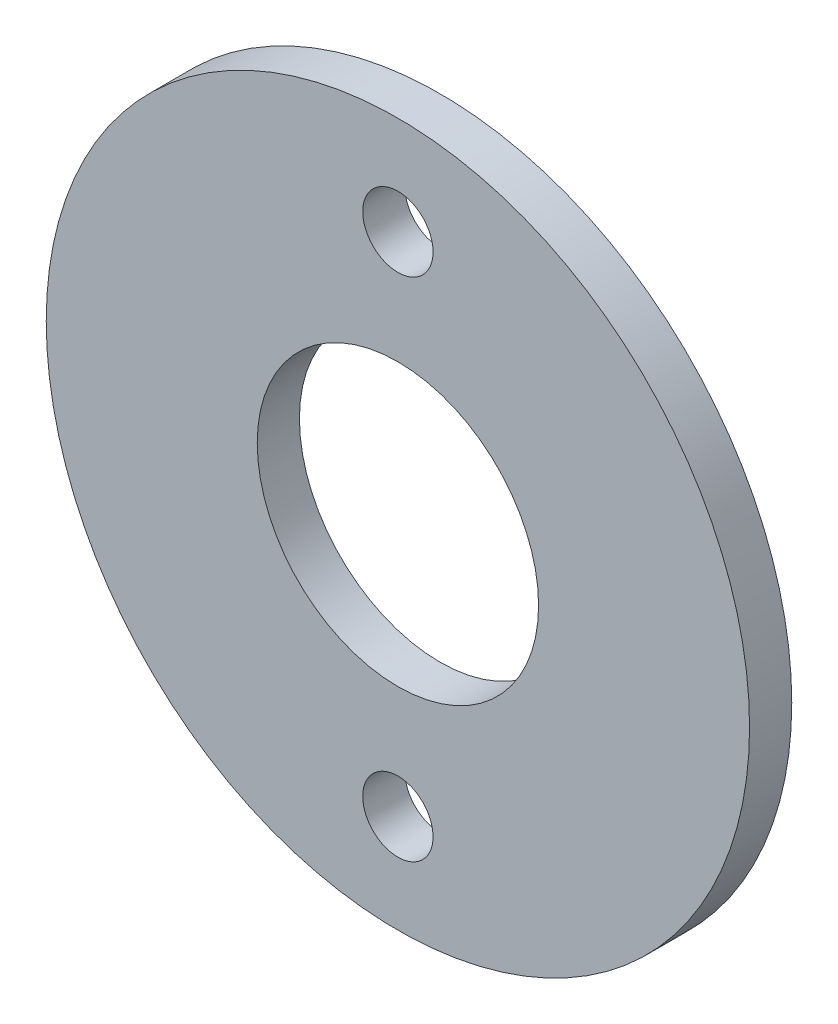
ISO-10303-21;
HEADER;
FILE_DESCRIPTION(('STEP AP214'),'2;1');
FILE_NAME('part.step','',(''),(''),'','','');
FILE_SCHEMA(('AUTOMOTIVE_DESIGN { 1 0 10303 214 1 1 1 1 }'));
ENDSEC;
DATA;
#1=APPLICATION_CONTEXT('core data for automotive mechanical design processes');
#2=APPLICATION_PROTOCOL_DEFINITION('international standard','automotive_design',2000,#1);
#3=PRODUCT_CONTEXT('',#1,'mechanical');
#4=PRODUCT('Part','Part','',(#3));
#5=PRODUCT_RELATED_PRODUCT_CATEGORY('part','',(#4));
#6=PRODUCT_DEFINITION_FORMATION('','',#4);
#7=PRODUCT_DEFINITION_CONTEXT('part definition',#1,'design');
#8=PRODUCT_DEFINITION('design','',#6,#7);
#9=PRODUCT_DEFINITION_SHAPE('','',#8);
#10=(LENGTH_UNIT() NAMED_UNIT(*) SI_UNIT(.MILLI.,.METRE.));
#11=(NAMED_UNIT(*) PLANE_ANGLE_UNIT() SI_UNIT($,.RADIAN.));
#12=(NAMED_UNIT(*) SI_UNIT($,.STERADIAN.) SOLID_ANGLE_UNIT());
#13=UNCERTAINTY_MEASURE_WITH_UNIT(LENGTH_MEASURE(1.E-05),#10,'distance_accuracy_value','');
#14=(GEOMETRIC_REPRESENTATION_CONTEXT(3) GLOBAL_UNCERTAINTY_ASSIGNED_CONTEXT((#13)) GLOBAL_UNIT_ASSIGNED_CONTEXT((#10,
#11,#12)) REPRESENTATION_CONTEXT('',''));
#15=CARTESIAN_POINT('',(0.,0.,0.));
#16=DIRECTION('',(0.,0.,1.));
#17=DIRECTION('',(1.,0.,0.));
#18=AXIS2_PLACEMENT_3D('',#15,#16,#17);
#19=CARTESIAN_POINT('',(0.,0.,1.5));
#20=DIRECTION('',(0.,0.,1.));
#21=DIRECTION('',(1.,0.,0.));
#22=AXIS2_PLACEMENT_3D('',#19,#20,#21);
#23=PLANE('',#22);
#24=CARTESIAN_POINT('',(0.,9.,1.5));
#25=DIRECTION('',(0.,0.,1.));
#26=DIRECTION('',(1.,0.,0.));
#27=AXIS2_PLACEMENT_3D('',#24,#25,#26);
#28=CIRCLE('',#27,1.25);
#29=CARTESIAN_POINT('',(1.25,9.,1.5));
#30=VERTEX_POINT('',#29);
#31=EDGE_CURVE('E55',#30,#30,#28,.T.);
#32=ORIENTED_EDGE('',*,*,#31,.F.);
#33=EDGE_LOOP('',(#32));
#34=FACE_BOUND('',#33,.T.);
#35=CARTESIAN_POINT('',(0.,-9.,1.5));
#36=DIRECTION('',(0.,0.,1.));
#37=DIRECTION('',(-1.,0.,0.));
#38=AXIS2_PLACEMENT_3D('',#35,#36,#37);
#39=CIRCLE('',#38,1.25);
#40=CARTESIAN_POINT('',(-1.25,-9.,1.5));
#41=VERTEX_POINT('',#40);
#42=EDGE_CURVE('E49',#41,#41,#39,.T.);
#43=ORIENTED_EDGE('',*,*,#42,.F.);
#44=EDGE_LOOP('',(#43));
#45=FACE_BOUND('',#44,.T.);
#46=CARTESIAN_POINT('',(0.,0.,1.5));
#47=DIRECTION('',(0.,0.,1.));
#48=DIRECTION('',(1.,0.,0.));
#49=AXIS2_PLACEMENT_3D('',#46,#47,#48);
#50=CIRCLE('',#49,12.5);
#51=CARTESIAN_POINT('',(12.5,0.,1.5));
#52=VERTEX_POINT('',#51);
#53=EDGE_CURVE('E10',#52,#52,#50,.T.);
#54=ORIENTED_EDGE('',*,*,#53,.T.);
#55=EDGE_LOOP('',(#54));
#56=FACE_BOUND('',#55,.T.);
#57=CARTESIAN_POINT('',(0.,0.,1.5));
#58=DIRECTION('',(0.,0.,1.));
#59=DIRECTION('',(1.,0.,0.));
#60=AXIS2_PLACEMENT_3D('',#57,#58,#59);
#61=CIRCLE('',#60,5.);
#62=CARTESIAN_POINT('',(5.,0.,1.5));
#63=VERTEX_POINT('',#62);
#64=EDGE_CURVE('E41',#63,#63,#61,.T.);
#65=ORIENTED_EDGE('',*,*,#64,.F.);
#66=EDGE_LOOP('',(#65));
#67=FACE_BOUND('',#66,.T.);
#68=ADVANCED_FACE('F30',(#34,#45,#56,#67),#23,.T.);
#69=CARTESIAN_POINT('',(0.,0.,0.));
#70=DIRECTION('',(0.,0.,1.));
#71=DIRECTION('',(1.,0.,0.));
#72=AXIS2_PLACEMENT_3D('',#69,#70,#71);
#73=PLANE('',#72);
#74=CARTESIAN_POINT('',(0.,9.,0.));
#75=DIRECTION('',(0.,0.,1.));
#76=DIRECTION('',(1.,0.,0.));
#77=AXIS2_PLACEMENT_3D('',#74,#75,#76);
#78=CIRCLE('',#77,1.25);
#79=CARTESIAN_POINT('',(1.25,9.,0.));
#80=VERTEX_POINT('',#79);
#81=EDGE_CURVE('E46',#80,#80,#78,.T.);
#82=ORIENTED_EDGE('',*,*,#81,.T.);
#83=EDGE_LOOP('',(#82));
#84=FACE_BOUND('',#83,.T.);
#85=CARTESIAN_POINT('',(0.,-9.,0.));
#86=DIRECTION('',(0.,0.,1.));
#87=DIRECTION('',(-1.,0.,0.));
#88=AXIS2_PLACEMENT_3D('',#85,#86,#87);
#89=CIRCLE('',#88,1.25);
#90=CARTESIAN_POINT('',(-1.25,-9.,0.));
#91=VERTEX_POINT('',#90);
#92=EDGE_CURVE('E52',#91,#91,#89,.T.);
#93=ORIENTED_EDGE('',*,*,#92,.T.);
#94=EDGE_LOOP('',(#93));
#95=FACE_BOUND('',#94,.T.);
#96=CARTESIAN_POINT('',(0.,0.,0.));
#97=DIRECTION('',(0.,0.,1.));
#98=DIRECTION('',(1.,0.,0.));
#99=AXIS2_PLACEMENT_3D('',#96,#97,#98);
#100=CIRCLE('',#99,12.5);
#101=CARTESIAN_POINT('',(12.5,0.,0.));
#102=VERTEX_POINT('',#101);
#103=EDGE_CURVE('E34',#102,#102,#100,.T.);
#104=ORIENTED_EDGE('',*,*,#103,.F.);
#105=EDGE_LOOP('',(#104));
#106=FACE_BOUND('',#105,.T.);
#107=CARTESIAN_POINT('',(0.,0.,0.));
#108=DIRECTION('',(0.,0.,1.));
#109=DIRECTION('',(1.,0.,0.));
#110=AXIS2_PLACEMENT_3D('',#107,#108,#109);
#111=CIRCLE('',#110,5.);
#112=CARTESIAN_POINT('',(5.,0.,0.));
#113=VERTEX_POINT('',#112);
#114=EDGE_CURVE('E43',#113,#113,#111,.T.);
#115=ORIENTED_EDGE('',*,*,#114,.T.);
#116=EDGE_LOOP('',(#115));
#117=FACE_BOUND('',#116,.T.);
#118=ADVANCED_FACE('F61',(#84,#95,#106,#117),#73,.F.);
#119=CARTESIAN_POINT('',(0.,0.,1.5));
#120=DIRECTION('',(0.,0.,-1.));
#121=DIRECTION('',(-1.,0.,0.));
#122=AXIS2_PLACEMENT_3D('',#119,#120,#121);
#123=CYLINDRICAL_SURFACE('',#122,12.5);
#124=ORIENTED_EDGE('',*,*,#53,.F.);
#125=EDGE_LOOP('',(#124));
#126=FACE_BOUND('',#125,.T.);
#127=ORIENTED_EDGE('',*,*,#103,.T.);
#128=EDGE_LOOP('',(#127));
#129=FACE_BOUND('',#128,.T.);
#130=ADVANCED_FACE('F32',(#126,#129),#123,.T.);
#131=CARTESIAN_POINT('',(0.,0.,1.5));
#132=DIRECTION('',(0.,0.,-1.));
#133=DIRECTION('',(-1.,0.,0.));
#134=AXIS2_PLACEMENT_3D('',#131,#132,#133);
#135=CYLINDRICAL_SURFACE('',#134,5.);
#136=ORIENTED_EDGE('',*,*,#64,.T.);
#137=EDGE_LOOP('',(#136));
#138=FACE_BOUND('',#137,.T.);
#139=ORIENTED_EDGE('',*,*,#114,.F.);
#140=EDGE_LOOP('',(#139));
#141=FACE_BOUND('',#140,.T.);
#142=ADVANCED_FACE('F78',(#138,#141),#135,.F.);
#143=CARTESIAN_POINT('',(0.,-9.,0.));
#144=DIRECTION('',(0.,0.,1.));
#145=DIRECTION('',(1.,0.,0.));
#146=AXIS2_PLACEMENT_3D('',#143,#144,#145);
#147=CYLINDRICAL_SURFACE('',#146,1.25);
#148=ORIENTED_EDGE('',*,*,#92,.F.);
#149=EDGE_LOOP('',(#148));
#150=FACE_BOUND('',#149,.T.);
#151=ORIENTED_EDGE('',*,*,#42,.T.);
#152=EDGE_LOOP('',(#151));
#153=FACE_BOUND('',#152,.T.);
#154=ADVANCED_FACE('F67',(#150,#153),#147,.F.);
#155=CARTESIAN_POINT('',(0.,9.,0.));
#156=DIRECTION('',(0.,0.,1.));
#157=DIRECTION('',(1.,0.,0.));
#158=AXIS2_PLACEMENT_3D('',#155,#156,#157);
#159=CYLINDRICAL_SURFACE('',#158,1.25);
#160=ORIENTED_EDGE('',*,*,#81,.F.);
#161=EDGE_LOOP('',(#160));
#162=FACE_BOUND('',#161,.T.);
#163=ORIENTED_EDGE('',*,*,#31,.T.);
#164=EDGE_LOOP('',(#163));
#165=FACE_BOUND('',#164,.T.);
#166=ADVANCED_FACE('F64',(#162,#165),#159,.F.);
#167=CLOSED_SHELL('',(#68,#118,#130,#142,#154,#166));
#168=MANIFOLD_SOLID_BREP('B2',#167);
#169=ADVANCED_BREP_SHAPE_REPRESENTATION('',(#18,#168),#14);
#170=SHAPE_DEFINITION_REPRESENTATION(#9,#169);
ENDSEC;
END-ISO-10303-21;
